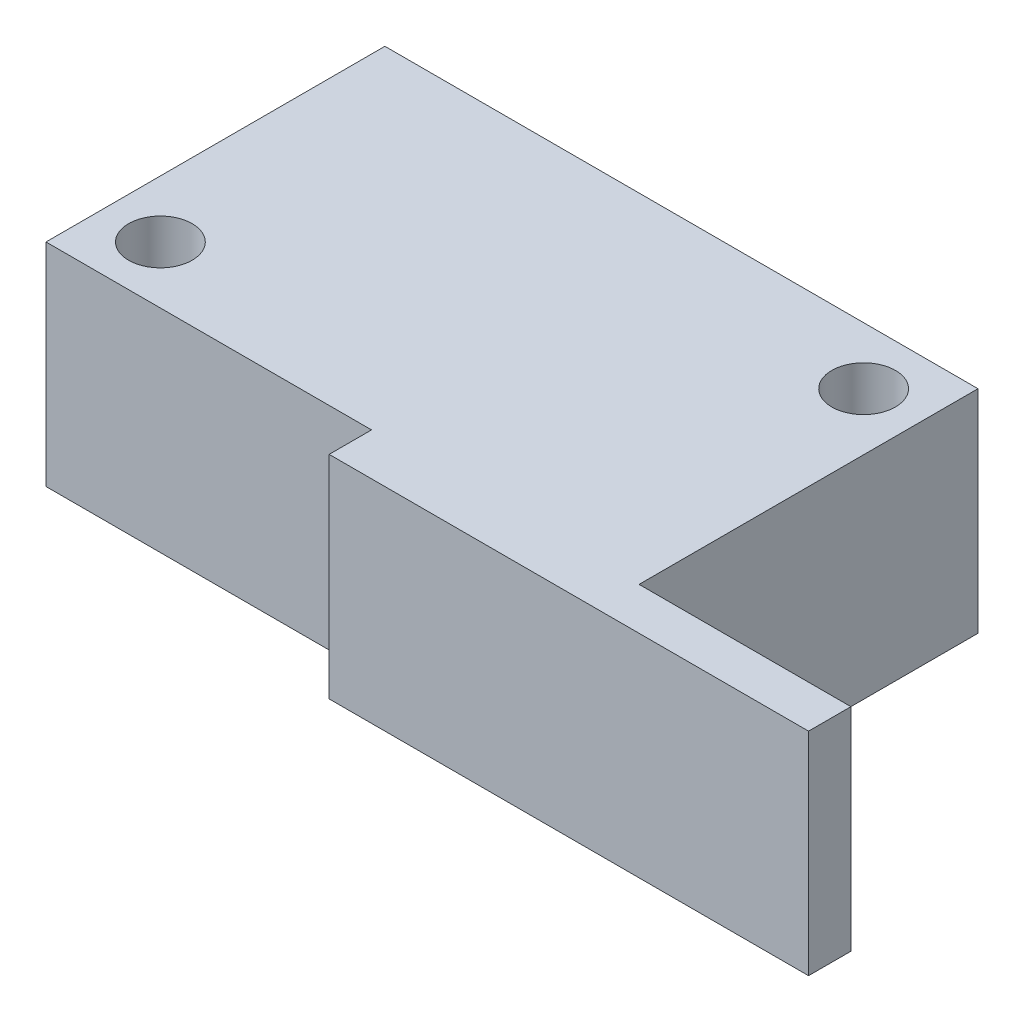
ISO-10303-21;
HEADER;
FILE_DESCRIPTION(('STEP AP214'),'2;1');
FILE_NAME('part.step','',(''),(''),'','','');
FILE_SCHEMA(('AUTOMOTIVE_DESIGN { 1 0 10303 214 1 1 1 1 }'));
ENDSEC;
DATA;
#1=APPLICATION_CONTEXT('core data for automotive mechanical design processes');
#2=APPLICATION_PROTOCOL_DEFINITION('international standard','automotive_design',2000,#1);
#3=PRODUCT_CONTEXT('',#1,'mechanical');
#4=PRODUCT('Part','Part','',(#3));
#5=PRODUCT_RELATED_PRODUCT_CATEGORY('part','',(#4));
#6=PRODUCT_DEFINITION_FORMATION('','',#4);
#7=PRODUCT_DEFINITION_CONTEXT('part definition',#1,'design');
#8=PRODUCT_DEFINITION('design','',#6,#7);
#9=PRODUCT_DEFINITION_SHAPE('','',#8);
#10=(LENGTH_UNIT() NAMED_UNIT(*) SI_UNIT(.MILLI.,.METRE.));
#11=(NAMED_UNIT(*) PLANE_ANGLE_UNIT() SI_UNIT($,.RADIAN.));
#12=(NAMED_UNIT(*) SI_UNIT($,.STERADIAN.) SOLID_ANGLE_UNIT());
#13=UNCERTAINTY_MEASURE_WITH_UNIT(LENGTH_MEASURE(1.E-05),#10,'distance_accuracy_value','');
#14=(GEOMETRIC_REPRESENTATION_CONTEXT(3) GLOBAL_UNCERTAINTY_ASSIGNED_CONTEXT((#13)) GLOBAL_UNIT_ASSIGNED_CONTEXT((#10,
#11,#12)) REPRESENTATION_CONTEXT('',''));
#15=CARTESIAN_POINT('',(0.,0.,0.));
#16=DIRECTION('',(0.,0.,1.));
#17=DIRECTION('',(1.,0.,0.));
#18=AXIS2_PLACEMENT_3D('',#15,#16,#17);
#19=CARTESIAN_POINT('',(-14.,10.,8.));
#20=DIRECTION('',(0.,0.,-1.00000000000003));
#21=DIRECTION('',(-1.00000000000003,0.,0.));
#22=AXIS2_PLACEMENT_3D('',#19,#20,#21);
#23=PLANE('',#22);
#24=DIRECTION('',(0.,-1.,0.));
#25=VECTOR('',#24,1.);
#26=CARTESIAN_POINT('',(1.36819864077609,10.,8.));
#27=LINE('',#26,#25);
#28=CARTESIAN_POINT('',(1.36819864077609,10.,8.));
#29=VERTEX_POINT('',#28);
#30=CARTESIAN_POINT('',(1.36819864077609,0.,8.));
#31=VERTEX_POINT('',#30);
#32=EDGE_CURVE('E54',#29,#31,#27,.T.);
#33=ORIENTED_EDGE('',*,*,#32,.F.);
#34=DIRECTION('',(1.00000000000003,0.,0.));
#35=VECTOR('',#34,1.);
#36=CARTESIAN_POINT('',(-14.,10.,8.));
#37=LINE('',#36,#35);
#38=CARTESIAN_POINT('',(-14.,10.,8.));
#39=VERTEX_POINT('',#38);
#40=EDGE_CURVE('E158',#39,#29,#37,.T.);
#41=ORIENTED_EDGE('',*,*,#40,.F.);
#42=DIRECTION('',(0.,-1.,0.));
#43=VECTOR('',#42,1.);
#44=CARTESIAN_POINT('',(-14.,10.,8.));
#45=LINE('',#44,#43);
#46=CARTESIAN_POINT('',(-14.,0.,8.));
#47=VERTEX_POINT('',#46);
#48=EDGE_CURVE('E167',#39,#47,#45,.T.);
#49=ORIENTED_EDGE('',*,*,#48,.T.);
#50=DIRECTION('',(1.00000000000003,0.,0.));
#51=VECTOR('',#50,1.);
#52=CARTESIAN_POINT('',(-14.,0.,8.));
#53=LINE('',#52,#51);
#54=EDGE_CURVE('E154',#47,#31,#53,.T.);
#55=ORIENTED_EDGE('',*,*,#54,.T.);
#56=EDGE_LOOP('',(#33,#41,#49,#55));
#57=FACE_BOUND('',#56,.T.);
#58=ADVANCED_FACE('F39',(#57),#23,.F.);
#59=CARTESIAN_POINT('',(14.,10.,-8.00000000000045));
#60=DIRECTION('',(-1.00000000000003,0.,0.));
#61=DIRECTION('',(0.,0.,1.00000000000003));
#62=AXIS2_PLACEMENT_3D('',#59,#60,#61);
#63=PLANE('',#62);
#64=DIRECTION('',(0.,0.,-1.00000000000003));
#65=VECTOR('',#64,1.);
#66=CARTESIAN_POINT('',(14.,0.,-8.00000000000045));
#67=LINE('',#66,#65);
#68=CARTESIAN_POINT('',(14.,0.,8.));
#69=VERTEX_POINT('',#68);
#70=CARTESIAN_POINT('',(14.,0.,-8.00000000000045));
#71=VERTEX_POINT('',#70);
#72=EDGE_CURVE('E149',#69,#71,#67,.T.);
#73=ORIENTED_EDGE('',*,*,#72,.T.);
#74=DIRECTION('',(0.,-1.,0.));
#75=VECTOR('',#74,1.);
#76=CARTESIAN_POINT('',(14.,10.,-8.00000000000045));
#77=LINE('',#76,#75);
#78=CARTESIAN_POINT('',(14.,10.,-8.00000000000045));
#79=VERTEX_POINT('',#78);
#80=EDGE_CURVE('E11',#79,#71,#77,.T.);
#81=ORIENTED_EDGE('',*,*,#80,.F.);
#82=DIRECTION('',(0.,0.,-1.00000000000003));
#83=VECTOR('',#82,1.);
#84=CARTESIAN_POINT('',(14.,10.,-8.00000000000045));
#85=LINE('',#84,#83);
#86=CARTESIAN_POINT('',(14.,10.,8.));
#87=VERTEX_POINT('',#86);
#88=EDGE_CURVE('E63',#87,#79,#85,.T.);
#89=ORIENTED_EDGE('',*,*,#88,.F.);
#90=DIRECTION('',(0.,-1.,0.));
#91=VECTOR('',#90,1.);
#92=CARTESIAN_POINT('',(14.,10.,8.));
#93=LINE('',#92,#91);
#94=EDGE_CURVE('E82',#87,#69,#93,.T.);
#95=ORIENTED_EDGE('',*,*,#94,.T.);
#96=EDGE_LOOP('',(#73,#81,#89,#95));
#97=FACE_BOUND('',#96,.T.);
#98=ADVANCED_FACE('F41',(#97),#63,.F.);
#99=CARTESIAN_POINT('',(-14.,10.,-8.00000000000045));
#100=DIRECTION('',(0.,0.,1.00000000000003));
#101=DIRECTION('',(1.00000000000003,0.,0.));
#102=AXIS2_PLACEMENT_3D('',#99,#100,#101);
#103=PLANE('',#102);
#104=DIRECTION('',(-1.00000000000003,0.,0.));
#105=VECTOR('',#104,1.);
#106=CARTESIAN_POINT('',(-14.,0.,-8.00000000000045));
#107=LINE('',#106,#105);
#108=CARTESIAN_POINT('',(-14.,0.,-8.00000000000045));
#109=VERTEX_POINT('',#108);
#110=EDGE_CURVE('E161',#71,#109,#107,.T.);
#111=ORIENTED_EDGE('',*,*,#110,.T.);
#112=DIRECTION('',(0.,-1.,0.));
#113=VECTOR('',#112,1.);
#114=CARTESIAN_POINT('',(-14.,10.,-8.00000000000045));
#115=LINE('',#114,#113);
#116=CARTESIAN_POINT('',(-14.,10.,-8.00000000000045));
#117=VERTEX_POINT('',#116);
#118=EDGE_CURVE('E47',#117,#109,#115,.T.);
#119=ORIENTED_EDGE('',*,*,#118,.F.);
#120=DIRECTION('',(-1.00000000000003,0.,0.));
#121=VECTOR('',#120,1.);
#122=CARTESIAN_POINT('',(-14.,10.,-8.00000000000045));
#123=LINE('',#122,#121);
#124=EDGE_CURVE('E89',#79,#117,#123,.T.);
#125=ORIENTED_EDGE('',*,*,#124,.F.);
#126=ORIENTED_EDGE('',*,*,#80,.T.);
#127=EDGE_LOOP('',(#111,#119,#125,#126));
#128=FACE_BOUND('',#127,.T.);
#129=ADVANCED_FACE('F197',(#128),#103,.F.);
#130=CARTESIAN_POINT('',(-14.,10.,-8.00000000000045));
#131=DIRECTION('',(1.00000000000003,0.,0.));
#132=DIRECTION('',(0.,0.,-1.00000000000003));
#133=AXIS2_PLACEMENT_3D('',#130,#131,#132);
#134=PLANE('',#133);
#135=DIRECTION('',(0.,0.,1.00000000000003));
#136=VECTOR('',#135,1.);
#137=CARTESIAN_POINT('',(-14.,0.,-8.00000000000045));
#138=LINE('',#137,#136);
#139=EDGE_CURVE('E163',#109,#47,#138,.T.);
#140=ORIENTED_EDGE('',*,*,#139,.T.);
#141=ORIENTED_EDGE('',*,*,#48,.F.);
#142=DIRECTION('',(0.,0.,1.00000000000003));
#143=VECTOR('',#142,1.);
#144=CARTESIAN_POINT('',(-14.,10.,-8.00000000000045));
#145=LINE('',#144,#143);
#146=EDGE_CURVE('E156',#117,#39,#145,.T.);
#147=ORIENTED_EDGE('',*,*,#146,.F.);
#148=ORIENTED_EDGE('',*,*,#118,.T.);
#149=EDGE_LOOP('',(#140,#141,#147,#148));
#150=FACE_BOUND('',#149,.T.);
#151=ADVANCED_FACE('F173',(#150),#134,.F.);
#152=CARTESIAN_POINT('',(0.,10.,0.));
#153=DIRECTION('',(0.,1.,0.));
#154=DIRECTION('',(0.,0.,1.00000000000003));
#155=AXIS2_PLACEMENT_3D('',#152,#153,#154);
#156=PLANE('',#155);
#157=CARTESIAN_POINT('',(-11.3,10.,5.3));
#158=DIRECTION('',(0.,1.,0.));
#159=DIRECTION('',(0.,0.,1.00000000000003));
#160=AXIS2_PLACEMENT_3D('',#157,#158,#159);
#161=CIRCLE('',#160,1.5);
#162=CARTESIAN_POINT('',(-11.3,10.,6.80000000000004));
#163=VERTEX_POINT('',#162);
#164=EDGE_CURVE('E144',#163,#163,#161,.T.);
#165=ORIENTED_EDGE('',*,*,#164,.F.);
#166=EDGE_LOOP('',(#165));
#167=FACE_BOUND('',#166,.T.);
#168=CARTESIAN_POINT('',(11.3,10.,-5.30000000000022));
#169=DIRECTION('',(0.,1.,0.));
#170=DIRECTION('',(0.,0.,1.00000000000003));
#171=AXIS2_PLACEMENT_3D('',#168,#169,#170);
#172=CIRCLE('',#171,1.5);
#173=CARTESIAN_POINT('',(11.3,10.,-3.80000000000018));
#174=VERTEX_POINT('',#173);
#175=EDGE_CURVE('E135',#174,#174,#172,.T.);
#176=ORIENTED_EDGE('',*,*,#175,.F.);
#177=EDGE_LOOP('',(#176));
#178=FACE_BOUND('',#177,.T.);
#179=ORIENTED_EDGE('',*,*,#88,.T.);
#180=ORIENTED_EDGE('',*,*,#124,.T.);
#181=ORIENTED_EDGE('',*,*,#146,.T.);
#182=ORIENTED_EDGE('',*,*,#40,.T.);
#183=DIRECTION('',(0.,0.,-1.00000000000003));
#184=VECTOR('',#183,1.);
#185=CARTESIAN_POINT('',(1.36819864077609,10.,10.));
#186=LINE('',#185,#184);
#187=CARTESIAN_POINT('',(1.36819864077609,10.,10.));
#188=VERTEX_POINT('',#187);
#189=EDGE_CURVE('E177',#188,#29,#186,.T.);
#190=ORIENTED_EDGE('',*,*,#189,.F.);
#191=DIRECTION('',(-1.00000000000003,0.,0.));
#192=VECTOR('',#191,1.);
#193=CARTESIAN_POINT('',(1.36819864077609,10.,10.));
#194=LINE('',#193,#192);
#195=CARTESIAN_POINT('',(24.,10.,10.));
#196=VERTEX_POINT('',#195);
#197=EDGE_CURVE('E128',#196,#188,#194,.T.);
#198=ORIENTED_EDGE('',*,*,#197,.F.);
#199=DIRECTION('',(0.,0.,-1.00000000000003));
#200=VECTOR('',#199,1.);
#201=CARTESIAN_POINT('',(24.,10.,10.));
#202=LINE('',#201,#200);
#203=CARTESIAN_POINT('',(24.,10.,8.));
#204=VERTEX_POINT('',#203);
#205=EDGE_CURVE('E140',#196,#204,#202,.T.);
#206=ORIENTED_EDGE('',*,*,#205,.T.);
#207=DIRECTION('',(-1.00000000000003,0.,0.));
#208=VECTOR('',#207,1.);
#209=CARTESIAN_POINT('',(1.36819864077609,10.,8.));
#210=LINE('',#209,#208);
#211=EDGE_CURVE('E132',#204,#87,#210,.T.);
#212=ORIENTED_EDGE('',*,*,#211,.T.);
#213=EDGE_LOOP('',(#179,#180,#181,#182,#190,#198,#206,#212));
#214=FACE_BOUND('',#213,.T.);
#215=ADVANCED_FACE('F176',(#167,#178,#214),#156,.T.);
#216=CARTESIAN_POINT('',(0.,0.,0.));
#217=DIRECTION('',(0.,1.,0.));
#218=DIRECTION('',(0.,0.,1.00000000000003));
#219=AXIS2_PLACEMENT_3D('',#216,#217,#218);
#220=PLANE('',#219);
#221=CARTESIAN_POINT('',(-11.3,0.,5.3));
#222=DIRECTION('',(0.,1.,0.));
#223=DIRECTION('',(0.,0.,1.00000000000003));
#224=AXIS2_PLACEMENT_3D('',#221,#222,#223);
#225=CIRCLE('',#224,1.5);
#226=CARTESIAN_POINT('',(-11.3,0.,6.80000000000004));
#227=VERTEX_POINT('',#226);
#228=EDGE_CURVE('E147',#227,#227,#225,.F.);
#229=ORIENTED_EDGE('',*,*,#228,.F.);
#230=EDGE_LOOP('',(#229));
#231=FACE_BOUND('',#230,.T.);
#232=CARTESIAN_POINT('',(11.3,0.,-5.30000000000022));
#233=DIRECTION('',(0.,1.,0.));
#234=DIRECTION('',(0.,0.,1.00000000000003));
#235=AXIS2_PLACEMENT_3D('',#232,#233,#234);
#236=CIRCLE('',#235,1.5);
#237=CARTESIAN_POINT('',(11.3,0.,-3.80000000000018));
#238=VERTEX_POINT('',#237);
#239=EDGE_CURVE('E138',#238,#238,#236,.F.);
#240=ORIENTED_EDGE('',*,*,#239,.F.);
#241=EDGE_LOOP('',(#240));
#242=FACE_BOUND('',#241,.T.);
#243=ORIENTED_EDGE('',*,*,#72,.F.);
#244=DIRECTION('',(1.00000000000003,0.,0.));
#245=VECTOR('',#244,1.);
#246=CARTESIAN_POINT('',(1.36819864077609,0.,8.));
#247=LINE('',#246,#245);
#248=CARTESIAN_POINT('',(24.,0.,8.));
#249=VERTEX_POINT('',#248);
#250=EDGE_CURVE('E186',#69,#249,#247,.T.);
#251=ORIENTED_EDGE('',*,*,#250,.T.);
#252=DIRECTION('',(0.,0.,-1.00000000000003));
#253=VECTOR('',#252,1.);
#254=CARTESIAN_POINT('',(24.,0.,10.));
#255=LINE('',#254,#253);
#256=CARTESIAN_POINT('',(24.,0.,10.));
#257=VERTEX_POINT('',#256);
#258=EDGE_CURVE('E119',#257,#249,#255,.T.);
#259=ORIENTED_EDGE('',*,*,#258,.F.);
#260=DIRECTION('',(1.00000000000003,0.,0.));
#261=VECTOR('',#260,1.);
#262=CARTESIAN_POINT('',(1.36819864077609,0.,10.));
#263=LINE('',#262,#261);
#264=CARTESIAN_POINT('',(1.36819864077609,0.,10.));
#265=VERTEX_POINT('',#264);
#266=EDGE_CURVE('E112',#265,#257,#263,.T.);
#267=ORIENTED_EDGE('',*,*,#266,.F.);
#268=DIRECTION('',(0.,0.,-1.00000000000003));
#269=VECTOR('',#268,1.);
#270=CARTESIAN_POINT('',(1.36819864077609,0.,10.));
#271=LINE('',#270,#269);
#272=EDGE_CURVE('E117',#265,#31,#271,.T.);
#273=ORIENTED_EDGE('',*,*,#272,.T.);
#274=ORIENTED_EDGE('',*,*,#54,.F.);
#275=ORIENTED_EDGE('',*,*,#139,.F.);
#276=ORIENTED_EDGE('',*,*,#110,.F.);
#277=EDGE_LOOP('',(#243,#251,#259,#267,#273,#274,#275,#276));
#278=FACE_BOUND('',#277,.T.);
#279=ADVANCED_FACE('F114',(#231,#242,#278),#220,.F.);
#280=CARTESIAN_POINT('',(11.3,-0.000999999999973245,-5.30000000000022));
#281=DIRECTION('',(0.,1.,0.));
#282=DIRECTION('',(0.,0.,1.00000000000003));
#283=AXIS2_PLACEMENT_3D('',#280,#281,#282);
#284=CYLINDRICAL_SURFACE('',#283,1.5);
#285=ORIENTED_EDGE('',*,*,#175,.T.);
#286=EDGE_LOOP('',(#285));
#287=FACE_BOUND('',#286,.T.);
#288=ORIENTED_EDGE('',*,*,#239,.T.);
#289=EDGE_LOOP('',(#288));
#290=FACE_BOUND('',#289,.T.);
#291=ADVANCED_FACE('F214',(#287,#290),#284,.F.);
#292=CARTESIAN_POINT('',(-11.3,-0.000999999999973245,5.3));
#293=DIRECTION('',(0.,1.,0.));
#294=DIRECTION('',(0.,0.,1.00000000000003));
#295=AXIS2_PLACEMENT_3D('',#292,#293,#294);
#296=CYLINDRICAL_SURFACE('',#295,1.5);
#297=ORIENTED_EDGE('',*,*,#164,.T.);
#298=EDGE_LOOP('',(#297));
#299=FACE_BOUND('',#298,.T.);
#300=ORIENTED_EDGE('',*,*,#228,.T.);
#301=EDGE_LOOP('',(#300));
#302=FACE_BOUND('',#301,.T.);
#303=ADVANCED_FACE('F221',(#299,#302),#296,.F.);
#304=CARTESIAN_POINT('',(1.36819864077609,10.,10.));
#305=DIRECTION('',(1.00000000000003,0.,0.));
#306=DIRECTION('',(0.,0.,-1.00000000000003));
#307=AXIS2_PLACEMENT_3D('',#304,#305,#306);
#308=PLANE('',#307);
#309=ORIENTED_EDGE('',*,*,#32,.T.);
#310=ORIENTED_EDGE('',*,*,#272,.F.);
#311=DIRECTION('',(0.,-1.,0.));
#312=VECTOR('',#311,1.);
#313=CARTESIAN_POINT('',(1.36819864077609,10.,10.));
#314=LINE('',#313,#312);
#315=EDGE_CURVE('E123',#188,#265,#314,.T.);
#316=ORIENTED_EDGE('',*,*,#315,.F.);
#317=ORIENTED_EDGE('',*,*,#189,.T.);
#318=EDGE_LOOP('',(#309,#310,#316,#317));
#319=FACE_BOUND('',#318,.T.);
#320=ADVANCED_FACE('F134',(#319),#308,.F.);
#321=CARTESIAN_POINT('',(24.,10.,10.));
#322=DIRECTION('',(-1.00000000000003,0.,0.));
#323=DIRECTION('',(0.,0.,1.00000000000003));
#324=AXIS2_PLACEMENT_3D('',#321,#322,#323);
#325=PLANE('',#324);
#326=DIRECTION('',(0.,1.,0.));
#327=VECTOR('',#326,1.);
#328=CARTESIAN_POINT('',(24.,10.,8.));
#329=LINE('',#328,#327);
#330=EDGE_CURVE('E184',#249,#204,#329,.T.);
#331=ORIENTED_EDGE('',*,*,#330,.T.);
#332=ORIENTED_EDGE('',*,*,#205,.F.);
#333=DIRECTION('',(0.,1.,0.));
#334=VECTOR('',#333,1.);
#335=CARTESIAN_POINT('',(24.,10.,10.));
#336=LINE('',#335,#334);
#337=EDGE_CURVE('E122',#257,#196,#336,.T.);
#338=ORIENTED_EDGE('',*,*,#337,.F.);
#339=ORIENTED_EDGE('',*,*,#258,.T.);
#340=EDGE_LOOP('',(#331,#332,#338,#339));
#341=FACE_BOUND('',#340,.T.);
#342=ADVANCED_FACE('F191',(#341),#325,.F.);
#343=CARTESIAN_POINT('',(0.,0.,10.));
#344=DIRECTION('',(0.,0.,1.00000000000003));
#345=DIRECTION('',(1.00000000000003,0.,0.));
#346=AXIS2_PLACEMENT_3D('',#343,#344,#345);
#347=PLANE('',#346);
#348=ORIENTED_EDGE('',*,*,#315,.T.);
#349=ORIENTED_EDGE('',*,*,#266,.T.);
#350=ORIENTED_EDGE('',*,*,#337,.T.);
#351=ORIENTED_EDGE('',*,*,#197,.T.);
#352=EDGE_LOOP('',(#348,#349,#350,#351));
#353=FACE_BOUND('',#352,.T.);
#354=ADVANCED_FACE('F126',(#353),#347,.T.);
#355=CARTESIAN_POINT('',(0.,0.,8.));
#356=DIRECTION('',(0.,0.,1.00000000000003));
#357=DIRECTION('',(1.00000000000003,0.,0.));
#358=AXIS2_PLACEMENT_3D('',#355,#356,#357);
#359=PLANE('',#358);
#360=ORIENTED_EDGE('',*,*,#94,.F.);
#361=ORIENTED_EDGE('',*,*,#211,.F.);
#362=ORIENTED_EDGE('',*,*,#330,.F.);
#363=ORIENTED_EDGE('',*,*,#250,.F.);
#364=EDGE_LOOP('',(#360,#361,#362,#363));
#365=FACE_BOUND('',#364,.T.);
#366=ADVANCED_FACE('F195',(#365),#359,.F.);
#367=CLOSED_SHELL('',(#58,#98,#129,#151,#215,#279,#291,#303,#320,#342,#354,#366));
#368=MANIFOLD_SOLID_BREP('B2',#367);
#369=ADVANCED_BREP_SHAPE_REPRESENTATION('',(#18,#368),#14);
#370=SHAPE_DEFINITION_REPRESENTATION(#9,#369);
ENDSEC;
END-ISO-10303-21;
